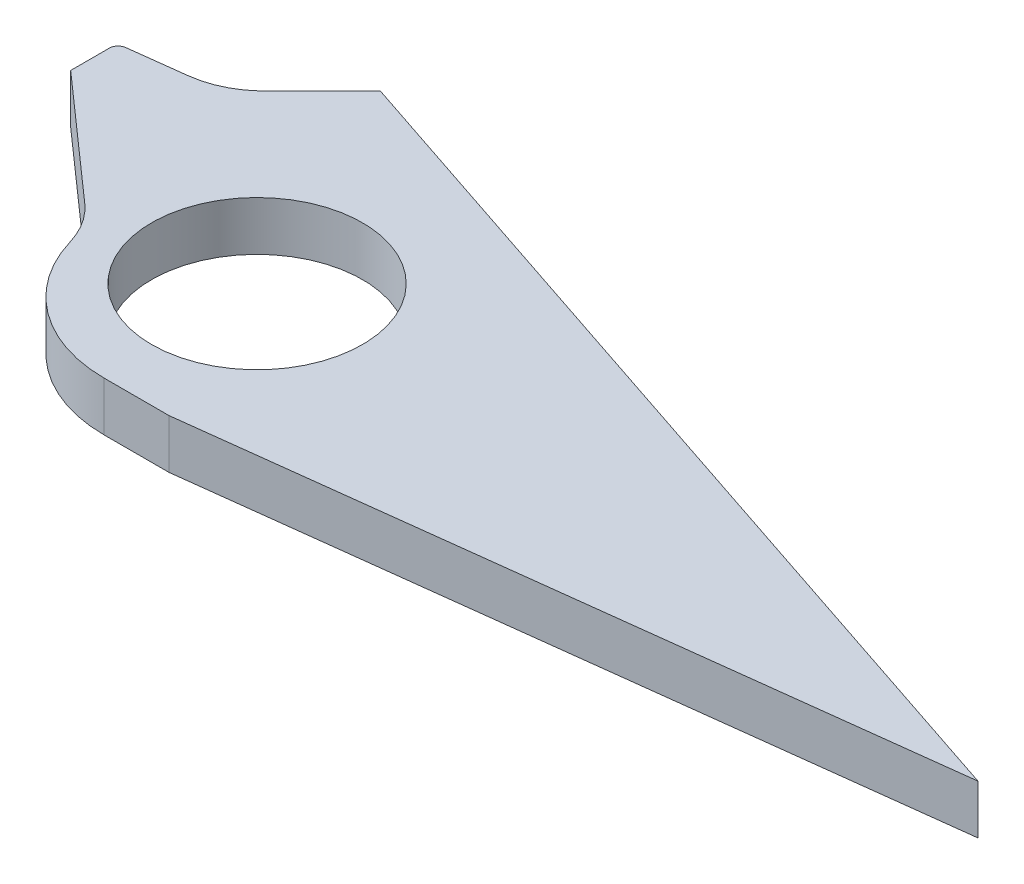
ISO-10303-21;
HEADER;
FILE_DESCRIPTION(('STEP AP214'),'2;1');
FILE_NAME('part.step','',(''),(''),'','','');
FILE_SCHEMA(('AUTOMOTIVE_DESIGN { 1 0 10303 214 1 1 1 1 }'));
ENDSEC;
DATA;
#1=APPLICATION_CONTEXT('core data for automotive mechanical design processes');
#2=APPLICATION_PROTOCOL_DEFINITION('international standard','automotive_design',2000,#1);
#3=PRODUCT_CONTEXT('',#1,'mechanical');
#4=PRODUCT('Part','Part','',(#3));
#5=PRODUCT_RELATED_PRODUCT_CATEGORY('part','',(#4));
#6=PRODUCT_DEFINITION_FORMATION('','',#4);
#7=PRODUCT_DEFINITION_CONTEXT('part definition',#1,'design');
#8=PRODUCT_DEFINITION('design','',#6,#7);
#9=PRODUCT_DEFINITION_SHAPE('','',#8);
#10=(LENGTH_UNIT() NAMED_UNIT(*) SI_UNIT(.MILLI.,.METRE.));
#11=(NAMED_UNIT(*) PLANE_ANGLE_UNIT() SI_UNIT($,.RADIAN.));
#12=(NAMED_UNIT(*) SI_UNIT($,.STERADIAN.) SOLID_ANGLE_UNIT());
#13=UNCERTAINTY_MEASURE_WITH_UNIT(LENGTH_MEASURE(1.E-05),#10,'distance_accuracy_value','');
#14=(GEOMETRIC_REPRESENTATION_CONTEXT(3) GLOBAL_UNCERTAINTY_ASSIGNED_CONTEXT((#13)) GLOBAL_UNIT_ASSIGNED_CONTEXT((#10,
#11,#12)) REPRESENTATION_CONTEXT('',''));
#15=CARTESIAN_POINT('',(0.,0.,0.));
#16=DIRECTION('',(0.,0.,1.));
#17=DIRECTION('',(1.,0.,0.));
#18=AXIS2_PLACEMENT_3D('',#15,#16,#17);
#19=CARTESIAN_POINT('',(0.,2.8,0.));
#20=DIRECTION('',(0.,-1.,0.));
#21=DIRECTION('',(0.,0.,-1.));
#22=AXIS2_PLACEMENT_3D('',#19,#20,#21);
#23=PLANE('',#22);
#24=CARTESIAN_POINT('',(-12.1601331036333,2.8,4.69548031513581));
#25=DIRECTION('',(0.,-1.,0.));
#26=DIRECTION('',(0.,0.,-1.));
#27=AXIS2_PLACEMENT_3D('',#24,#25,#26);
#28=CIRCLE('',#27,5.);
#29=CARTESIAN_POINT('',(-8.8472636926182,2.8,0.950497502683905));
#30=VERTEX_POINT('',#29);
#31=CARTESIAN_POINT('',(-7.36640838967638,2.8,3.27414173239127));
#32=VERTEX_POINT('',#31);
#33=EDGE_CURVE('E204',#30,#32,#28,.T.);
#34=ORIENTED_EDGE('',*,*,#33,.T.);
#35=CARTESIAN_POINT('',(0.303551152654753,2.8,1.));
#36=DIRECTION('',(0.,-1.,0.));
#37=DIRECTION('',(0.,0.,-1.));
#38=AXIS2_PLACEMENT_3D('',#35,#36,#37);
#39=CIRCLE('',#38,8.);
#40=CARTESIAN_POINT('',(0.303551152654754,2.8,9.));
#41=VERTEX_POINT('',#40);
#42=EDGE_CURVE('E11',#32,#41,#39,.F.);
#43=ORIENTED_EDGE('',*,*,#42,.T.);
#44=DIRECTION('',(1.,0.,0.));
#45=VECTOR('',#44,1.);
#46=CARTESIAN_POINT('',(4.,2.8,9.));
#47=LINE('',#46,#45);
#48=CARTESIAN_POINT('',(4.,2.8,9.));
#49=VERTEX_POINT('',#48);
#50=EDGE_CURVE('E149',#41,#49,#47,.T.);
#51=ORIENTED_EDGE('',*,*,#50,.T.);
#52=DIRECTION('',(0.992645877550526,0.,-0.12105437531104));
#53=VECTOR('',#52,1.);
#54=CARTESIAN_POINT('',(45.,2.8,3.99999999999999));
#55=LINE('',#54,#53);
#56=CARTESIAN_POINT('',(45.,2.8,3.99999999999999));
#57=VERTEX_POINT('',#56);
#58=EDGE_CURVE('E151',#49,#57,#55,.T.);
#59=ORIENTED_EDGE('',*,*,#58,.T.);
#60=DIRECTION('',(-0.948683298050514,0.,-0.316227766016838));
#61=VECTOR('',#60,1.);
#62=CARTESIAN_POINT('',(-6.,2.8,-13.));
#63=LINE('',#62,#61);
#64=CARTESIAN_POINT('',(-6.,2.8,-13.));
#65=VERTEX_POINT('',#64);
#66=EDGE_CURVE('E156',#57,#65,#63,.T.);
#67=ORIENTED_EDGE('',*,*,#66,.T.);
#68=DIRECTION('',(-0.707106781186548,0.,0.707106781186547));
#69=VECTOR('',#68,1.);
#70=CARTESIAN_POINT('',(-9.00000000000001,2.8,-10.));
#71=LINE('',#70,#69);
#72=CARTESIAN_POINT('',(-9.00000000000001,2.8,-10.));
#73=VERTEX_POINT('',#72);
#74=EDGE_CURVE('E158',#65,#73,#71,.T.);
#75=ORIENTED_EDGE('',*,*,#74,.T.);
#76=CARTESIAN_POINT('',(-12.8030585838502,2.8,-13.2460353368076));
#77=DIRECTION('',(0.,-1.,0.));
#78=DIRECTION('',(0.,0.,-1.));
#79=AXIS2_PLACEMENT_3D('',#76,#77,#78);
#80=CIRCLE('',#79,5.);
#81=CARTESIAN_POINT('',(-12.1937118668244,2.8,-8.28330457860096));
#82=VERTEX_POINT('',#81);
#83=EDGE_CURVE('E190',#73,#82,#80,.T.);
#84=ORIENTED_EDGE('',*,*,#83,.T.);
#85=DIRECTION('',(0.992546151641321,0.,-0.121869343405155));
#86=VECTOR('',#85,1.);
#87=CARTESIAN_POINT('',(-15.8,2.8,-7.84050807367962));
#88=LINE('',#87,#86);
#89=CARTESIAN_POINT('',(-15.3609346717026,2.8,-7.89441851722231));
#90=VERTEX_POINT('',#89);
#91=EDGE_CURVE('E185',#82,#90,#88,.F.);
#92=ORIENTED_EDGE('',*,*,#91,.T.);
#93=CARTESIAN_POINT('',(-15.3,2.8,-7.39814544140165));
#94=DIRECTION('',(0.,-1.,0.));
#95=DIRECTION('',(0.,0.,-1.));
#96=AXIS2_PLACEMENT_3D('',#93,#94,#95);
#97=CIRCLE('',#96,0.5);
#98=CARTESIAN_POINT('',(-15.8,2.8,-7.39814544140165));
#99=VERTEX_POINT('',#98);
#100=EDGE_CURVE('E129',#90,#99,#97,.F.);
#101=ORIENTED_EDGE('',*,*,#100,.T.);
#102=DIRECTION('',(0.,0.,1.));
#103=VECTOR('',#102,1.);
#104=CARTESIAN_POINT('',(-15.8,2.8,-8.7));
#105=LINE('',#104,#103);
#106=CARTESIAN_POINT('',(-15.8,2.8,-5.2));
#107=VERTEX_POINT('',#106);
#108=EDGE_CURVE('E122',#99,#107,#105,.T.);
#109=ORIENTED_EDGE('',*,*,#108,.T.);
#110=DIRECTION('',(0.748996562490381,0.,0.662573882203029));
#111=VECTOR('',#110,1.);
#112=CARTESIAN_POINT('',(-15.8,2.8,-5.2));
#113=LINE('',#112,#111);
#114=EDGE_CURVE('E126',#107,#30,#113,.T.);
#115=ORIENTED_EDGE('',*,*,#114,.T.);
#116=EDGE_LOOP('',(#34,#43,#51,#59,#67,#75,#84,#92,#101,#109,#115));
#117=FACE_BOUND('',#116,.T.);
#118=CARTESIAN_POINT('',(0.,2.8,0.));
#119=DIRECTION('',(0.,1.,0.));
#120=DIRECTION('',(0.,0.,1.));
#121=AXIS2_PLACEMENT_3D('',#118,#119,#120);
#122=CIRCLE('',#121,6.);
#123=CARTESIAN_POINT('',(0.,2.8,6.));
#124=VERTEX_POINT('',#123);
#125=EDGE_CURVE('E164',#124,#124,#122,.T.);
#126=ORIENTED_EDGE('',*,*,#125,.F.);
#127=EDGE_LOOP('',(#126));
#128=FACE_BOUND('',#127,.T.);
#129=ADVANCED_FACE('F40',(#117,#128),#23,.F.);
#130=CARTESIAN_POINT('',(0.,0.,0.));
#131=DIRECTION('',(0.,-1.,0.));
#132=DIRECTION('',(0.,0.,-1.));
#133=AXIS2_PLACEMENT_3D('',#130,#131,#132);
#134=PLANE('',#133);
#135=DIRECTION('',(1.,0.,0.));
#136=VECTOR('',#135,1.);
#137=CARTESIAN_POINT('',(4.,0.,9.));
#138=LINE('',#137,#136);
#139=CARTESIAN_POINT('',(0.303551152654754,0.,9.));
#140=VERTEX_POINT('',#139);
#141=CARTESIAN_POINT('',(4.,0.,9.));
#142=VERTEX_POINT('',#141);
#143=EDGE_CURVE('E166',#140,#142,#138,.T.);
#144=ORIENTED_EDGE('',*,*,#143,.F.);
#145=CARTESIAN_POINT('',(0.303551152654753,0.,1.));
#146=DIRECTION('',(0.,-1.,0.));
#147=DIRECTION('',(0.,0.,-1.));
#148=AXIS2_PLACEMENT_3D('',#145,#146,#147);
#149=CIRCLE('',#148,8.);
#150=CARTESIAN_POINT('',(-7.36640838967638,0.,3.27414173239127));
#151=VERTEX_POINT('',#150);
#152=EDGE_CURVE('E62',#140,#151,#149,.T.);
#153=ORIENTED_EDGE('',*,*,#152,.T.);
#154=CARTESIAN_POINT('',(-12.1601331036333,0.,4.69548031513581));
#155=DIRECTION('',(0.,-1.,0.));
#156=DIRECTION('',(0.,0.,-1.));
#157=AXIS2_PLACEMENT_3D('',#154,#155,#156);
#158=CIRCLE('',#157,5.);
#159=CARTESIAN_POINT('',(-8.8472636926182,0.,0.950497502683905));
#160=VERTEX_POINT('',#159);
#161=EDGE_CURVE('E202',#151,#160,#158,.F.);
#162=ORIENTED_EDGE('',*,*,#161,.T.);
#163=DIRECTION('',(0.748996562490381,0.,0.662573882203029));
#164=VECTOR('',#163,1.);
#165=CARTESIAN_POINT('',(-15.8,0.,-5.2));
#166=LINE('',#165,#164);
#167=CARTESIAN_POINT('',(-15.8,0.,-5.2));
#168=VERTEX_POINT('',#167);
#169=EDGE_CURVE('E163',#168,#160,#166,.T.);
#170=ORIENTED_EDGE('',*,*,#169,.F.);
#171=DIRECTION('',(0.,0.,1.));
#172=VECTOR('',#171,1.);
#173=CARTESIAN_POINT('',(-15.8,0.,-8.7));
#174=LINE('',#173,#172);
#175=CARTESIAN_POINT('',(-15.8,0.,-7.39814544140165));
#176=VERTEX_POINT('',#175);
#177=EDGE_CURVE('E139',#176,#168,#174,.T.);
#178=ORIENTED_EDGE('',*,*,#177,.F.);
#179=CARTESIAN_POINT('',(-15.3,0.,-7.39814544140165));
#180=DIRECTION('',(0.,-1.,0.));
#181=DIRECTION('',(0.,0.,-1.));
#182=AXIS2_PLACEMENT_3D('',#179,#180,#181);
#183=CIRCLE('',#182,0.5);
#184=CARTESIAN_POINT('',(-15.3609346717026,0.,-7.89441851722231));
#185=VERTEX_POINT('',#184);
#186=EDGE_CURVE('E196',#176,#185,#183,.T.);
#187=ORIENTED_EDGE('',*,*,#186,.T.);
#188=DIRECTION('',(-0.992546151641321,0.,0.121869343405155));
#189=VECTOR('',#188,1.);
#190=CARTESIAN_POINT('',(-1.18305905024425,0.,-9.63524274993917));
#191=LINE('',#190,#189);
#192=CARTESIAN_POINT('',(-12.1937118668244,0.,-8.28330457860096));
#193=VERTEX_POINT('',#192);
#194=EDGE_CURVE('E143',#185,#193,#191,.F.);
#195=ORIENTED_EDGE('',*,*,#194,.T.);
#196=CARTESIAN_POINT('',(-12.8030585838502,0.,-13.2460353368076));
#197=DIRECTION('',(0.,-1.,0.));
#198=DIRECTION('',(0.,0.,-1.));
#199=AXIS2_PLACEMENT_3D('',#196,#197,#198);
#200=CIRCLE('',#199,5.);
#201=CARTESIAN_POINT('',(-9.00000000000001,0.,-10.));
#202=VERTEX_POINT('',#201);
#203=EDGE_CURVE('E192',#193,#202,#200,.F.);
#204=ORIENTED_EDGE('',*,*,#203,.T.);
#205=DIRECTION('',(-0.707106781186548,0.,0.707106781186547));
#206=VECTOR('',#205,1.);
#207=CARTESIAN_POINT('',(-9.00000000000001,0.,-10.));
#208=LINE('',#207,#206);
#209=CARTESIAN_POINT('',(-6.,0.,-13.));
#210=VERTEX_POINT('',#209);
#211=EDGE_CURVE('E133',#210,#202,#208,.T.);
#212=ORIENTED_EDGE('',*,*,#211,.F.);
#213=DIRECTION('',(-0.948683298050514,0.,-0.316227766016838));
#214=VECTOR('',#213,1.);
#215=CARTESIAN_POINT('',(-6.,0.,-13.));
#216=LINE('',#215,#214);
#217=CARTESIAN_POINT('',(45.,0.,3.99999999999999));
#218=VERTEX_POINT('',#217);
#219=EDGE_CURVE('E170',#218,#210,#216,.T.);
#220=ORIENTED_EDGE('',*,*,#219,.F.);
#221=DIRECTION('',(0.992645877550526,0.,-0.12105437531104));
#222=VECTOR('',#221,1.);
#223=CARTESIAN_POINT('',(45.,0.,3.99999999999999));
#224=LINE('',#223,#222);
#225=EDGE_CURVE('E168',#142,#218,#224,.T.);
#226=ORIENTED_EDGE('',*,*,#225,.F.);
#227=EDGE_LOOP('',(#144,#153,#162,#170,#178,#187,#195,#204,#212,#220,#226));
#228=FACE_BOUND('',#227,.T.);
#229=CARTESIAN_POINT('',(0.,0.,0.));
#230=DIRECTION('',(0.,1.,0.));
#231=DIRECTION('',(0.,0.,1.));
#232=AXIS2_PLACEMENT_3D('',#229,#230,#231);
#233=CIRCLE('',#232,6.);
#234=CARTESIAN_POINT('',(0.,0.,6.));
#235=VERTEX_POINT('',#234);
#236=EDGE_CURVE('E395',#235,#235,#233,.T.);
#237=ORIENTED_EDGE('',*,*,#236,.T.);
#238=EDGE_LOOP('',(#237));
#239=FACE_BOUND('',#238,.T.);
#240=ADVANCED_FACE('F217',(#228,#239),#134,.T.);
#241=CARTESIAN_POINT('',(-15.8,2.8,-8.7));
#242=DIRECTION('',(1.,0.,0.));
#243=DIRECTION('',(0.,0.,-1.));
#244=AXIS2_PLACEMENT_3D('',#241,#242,#243);
#245=PLANE('',#244);
#246=ORIENTED_EDGE('',*,*,#108,.F.);
#247=DIRECTION('',(0.,1.,0.));
#248=VECTOR('',#247,1.);
#249=CARTESIAN_POINT('',(-15.8,0.,-7.39814544140165));
#250=LINE('',#249,#248);
#251=EDGE_CURVE('E194',#99,#176,#250,.F.);
#252=ORIENTED_EDGE('',*,*,#251,.T.);
#253=ORIENTED_EDGE('',*,*,#177,.T.);
#254=DIRECTION('',(0.,-1.,0.));
#255=VECTOR('',#254,1.);
#256=CARTESIAN_POINT('',(-15.8,2.8,-5.2));
#257=LINE('',#256,#255);
#258=EDGE_CURVE('E136',#107,#168,#257,.T.);
#259=ORIENTED_EDGE('',*,*,#258,.F.);
#260=EDGE_LOOP('',(#246,#252,#253,#259));
#261=FACE_BOUND('',#260,.T.);
#262=ADVANCED_FACE('F137',(#261),#245,.F.);
#263=CARTESIAN_POINT('',(-15.8,2.8,-5.2));
#264=DIRECTION('',(0.662573882203029,0.,-0.748996562490381));
#265=DIRECTION('',(-0.748996562490381,0.,-0.662573882203029));
#266=AXIS2_PLACEMENT_3D('',#263,#264,#265);
#267=PLANE('',#266);
#268=ORIENTED_EDGE('',*,*,#169,.T.);
#269=DIRECTION('',(0.,-1.,0.));
#270=VECTOR('',#269,1.);
#271=CARTESIAN_POINT('',(-8.8472636926182,2.8,0.950497502683904));
#272=LINE('',#271,#270);
#273=EDGE_CURVE('E148',#160,#30,#272,.F.);
#274=ORIENTED_EDGE('',*,*,#273,.T.);
#275=ORIENTED_EDGE('',*,*,#114,.F.);
#276=ORIENTED_EDGE('',*,*,#258,.T.);
#277=EDGE_LOOP('',(#268,#274,#275,#276));
#278=FACE_BOUND('',#277,.T.);
#279=ADVANCED_FACE('F146',(#278),#267,.F.);
#280=CARTESIAN_POINT('',(4.,2.8,9.));
#281=DIRECTION('',(0.,0.,-1.));
#282=DIRECTION('',(-1.,0.,0.));
#283=AXIS2_PLACEMENT_3D('',#280,#281,#282);
#284=PLANE('',#283);
#285=ORIENTED_EDGE('',*,*,#50,.F.);
#286=DIRECTION('',(0.,1.,0.));
#287=VECTOR('',#286,1.);
#288=CARTESIAN_POINT('',(0.303551152654754,2.8,9.));
#289=LINE('',#288,#287);
#290=EDGE_CURVE('E206',#41,#140,#289,.F.);
#291=ORIENTED_EDGE('',*,*,#290,.T.);
#292=ORIENTED_EDGE('',*,*,#143,.T.);
#293=DIRECTION('',(0.,-1.,0.));
#294=VECTOR('',#293,1.);
#295=CARTESIAN_POINT('',(4.,2.8,9.));
#296=LINE('',#295,#294);
#297=EDGE_CURVE('E144',#49,#142,#296,.T.);
#298=ORIENTED_EDGE('',*,*,#297,.F.);
#299=EDGE_LOOP('',(#285,#291,#292,#298));
#300=FACE_BOUND('',#299,.T.);
#301=ADVANCED_FACE('F212',(#300),#284,.F.);
#302=CARTESIAN_POINT('',(45.,2.8,3.99999999999999));
#303=DIRECTION('',(-0.12105437531104,0.,-0.992645877550526));
#304=DIRECTION('',(-0.992645877550526,0.,0.12105437531104));
#305=AXIS2_PLACEMENT_3D('',#302,#303,#304);
#306=PLANE('',#305);
#307=ORIENTED_EDGE('',*,*,#225,.T.);
#308=DIRECTION('',(0.,-1.,0.));
#309=VECTOR('',#308,1.);
#310=CARTESIAN_POINT('',(45.,2.8,3.99999999999999));
#311=LINE('',#310,#309);
#312=EDGE_CURVE('E179',#57,#218,#311,.T.);
#313=ORIENTED_EDGE('',*,*,#312,.F.);
#314=ORIENTED_EDGE('',*,*,#58,.F.);
#315=ORIENTED_EDGE('',*,*,#297,.T.);
#316=EDGE_LOOP('',(#307,#313,#314,#315));
#317=FACE_BOUND('',#316,.T.);
#318=ADVANCED_FACE('F223',(#317),#306,.F.);
#319=CARTESIAN_POINT('',(-6.,2.8,-13.));
#320=DIRECTION('',(-0.316227766016838,0.,0.948683298050514));
#321=DIRECTION('',(0.948683298050514,0.,0.316227766016838));
#322=AXIS2_PLACEMENT_3D('',#319,#320,#321);
#323=PLANE('',#322);
#324=ORIENTED_EDGE('',*,*,#219,.T.);
#325=DIRECTION('',(0.,-1.,0.));
#326=VECTOR('',#325,1.);
#327=CARTESIAN_POINT('',(-6.,2.8,-13.));
#328=LINE('',#327,#326);
#329=EDGE_CURVE('E176',#65,#210,#328,.T.);
#330=ORIENTED_EDGE('',*,*,#329,.F.);
#331=ORIENTED_EDGE('',*,*,#66,.F.);
#332=ORIENTED_EDGE('',*,*,#312,.T.);
#333=EDGE_LOOP('',(#324,#330,#331,#332));
#334=FACE_BOUND('',#333,.T.);
#335=ADVANCED_FACE('F227',(#334),#323,.F.);
#336=CARTESIAN_POINT('',(-9.00000000000001,2.8,-10.));
#337=DIRECTION('',(0.707106781186547,0.,0.707106781186548));
#338=DIRECTION('',(0.707106781186548,0.,-0.707106781186547));
#339=AXIS2_PLACEMENT_3D('',#336,#337,#338);
#340=PLANE('',#339);
#341=ORIENTED_EDGE('',*,*,#211,.T.);
#342=DIRECTION('',(0.,-1.,0.));
#343=VECTOR('',#342,1.);
#344=CARTESIAN_POINT('',(-9.00000000000001,2.8,-10.));
#345=LINE('',#344,#343);
#346=EDGE_CURVE('E161',#73,#202,#345,.T.);
#347=ORIENTED_EDGE('',*,*,#346,.F.);
#348=ORIENTED_EDGE('',*,*,#74,.F.);
#349=ORIENTED_EDGE('',*,*,#329,.T.);
#350=EDGE_LOOP('',(#341,#347,#348,#349));
#351=FACE_BOUND('',#350,.T.);
#352=ADVANCED_FACE('F246',(#351),#340,.F.);
#353=CARTESIAN_POINT('',(0.,2.8,0.));
#354=DIRECTION('',(0.,-1.,0.));
#355=DIRECTION('',(0.,0.,-1.));
#356=AXIS2_PLACEMENT_3D('',#353,#354,#355);
#357=CYLINDRICAL_SURFACE('',#356,6.);
#358=ORIENTED_EDGE('',*,*,#125,.T.);
#359=EDGE_LOOP('',(#358));
#360=FACE_BOUND('',#359,.T.);
#361=ORIENTED_EDGE('',*,*,#236,.F.);
#362=EDGE_LOOP('',(#361));
#363=FACE_BOUND('',#362,.T.);
#364=ADVANCED_FACE('F244',(#360,#363),#357,.F.);
#365=CARTESIAN_POINT('',(-15.8,2.8,-7.84050807367962));
#366=DIRECTION('',(0.121869343405155,0.,0.992546151641321));
#367=DIRECTION('',(0.,-1.,0.));
#368=AXIS2_PLACEMENT_3D('',#365,#366,#367);
#369=PLANE('',#368);
#370=ORIENTED_EDGE('',*,*,#194,.F.);
#371=DIRECTION('',(0.,-1.,0.));
#372=VECTOR('',#371,1.);
#373=CARTESIAN_POINT('',(-15.3609346717026,2.8,-7.89441851722231));
#374=LINE('',#373,#372);
#375=EDGE_CURVE('E198',#185,#90,#374,.F.);
#376=ORIENTED_EDGE('',*,*,#375,.T.);
#377=ORIENTED_EDGE('',*,*,#91,.F.);
#378=DIRECTION('',(0.,-1.,0.));
#379=VECTOR('',#378,1.);
#380=CARTESIAN_POINT('',(-12.1937118668244,0.,-8.28330457860096));
#381=LINE('',#380,#379);
#382=EDGE_CURVE('E187',#82,#193,#381,.T.);
#383=ORIENTED_EDGE('',*,*,#382,.T.);
#384=EDGE_LOOP('',(#370,#376,#377,#383));
#385=FACE_BOUND('',#384,.T.);
#386=ADVANCED_FACE('F261',(#385),#369,.F.);
#387=CARTESIAN_POINT('',(-12.8030585838502,2.8,-13.2460353368076));
#388=DIRECTION('',(0.,-1.,0.));
#389=DIRECTION('',(0.,0.,-1.));
#390=AXIS2_PLACEMENT_3D('',#387,#388,#389);
#391=CYLINDRICAL_SURFACE('',#390,5.);
#392=ORIENTED_EDGE('',*,*,#203,.F.);
#393=ORIENTED_EDGE('',*,*,#382,.F.);
#394=ORIENTED_EDGE('',*,*,#83,.F.);
#395=ORIENTED_EDGE('',*,*,#346,.T.);
#396=EDGE_LOOP('',(#392,#393,#394,#395));
#397=FACE_BOUND('',#396,.T.);
#398=ADVANCED_FACE('F266',(#397),#391,.F.);
#399=CARTESIAN_POINT('',(-15.3,2.8,-7.39814544140165));
#400=DIRECTION('',(0.,-1.,0.));
#401=DIRECTION('',(0.,0.,-1.));
#402=AXIS2_PLACEMENT_3D('',#399,#400,#401);
#403=CYLINDRICAL_SURFACE('',#402,0.5);
#404=ORIENTED_EDGE('',*,*,#100,.F.);
#405=ORIENTED_EDGE('',*,*,#375,.F.);
#406=ORIENTED_EDGE('',*,*,#186,.F.);
#407=ORIENTED_EDGE('',*,*,#251,.F.);
#408=EDGE_LOOP('',(#404,#405,#406,#407));
#409=FACE_BOUND('',#408,.T.);
#410=ADVANCED_FACE('F236',(#409),#403,.T.);
#411=CARTESIAN_POINT('',(-12.1601331036333,2.8,4.69548031513581));
#412=DIRECTION('',(0.,1.,0.));
#413=DIRECTION('',(0.,0.,1.));
#414=AXIS2_PLACEMENT_3D('',#411,#412,#413);
#415=CYLINDRICAL_SURFACE('',#414,5.);
#416=ORIENTED_EDGE('',*,*,#161,.F.);
#417=DIRECTION('',(0.,1.,0.));
#418=VECTOR('',#417,1.);
#419=CARTESIAN_POINT('',(-7.36640838967638,2.8,3.27414173239127));
#420=LINE('',#419,#418);
#421=EDGE_CURVE('E48',#151,#32,#420,.T.);
#422=ORIENTED_EDGE('',*,*,#421,.T.);
#423=ORIENTED_EDGE('',*,*,#33,.F.);
#424=ORIENTED_EDGE('',*,*,#273,.F.);
#425=EDGE_LOOP('',(#416,#422,#423,#424));
#426=FACE_BOUND('',#425,.T.);
#427=ADVANCED_FACE('F232',(#426),#415,.F.);
#428=CARTESIAN_POINT('',(0.303551152654753,2.8,1.));
#429=DIRECTION('',(0.,1.,0.));
#430=DIRECTION('',(0.,0.,1.));
#431=AXIS2_PLACEMENT_3D('',#428,#429,#430);
#432=CYLINDRICAL_SURFACE('',#431,8.);
#433=ORIENTED_EDGE('',*,*,#42,.F.);
#434=ORIENTED_EDGE('',*,*,#421,.F.);
#435=ORIENTED_EDGE('',*,*,#152,.F.);
#436=ORIENTED_EDGE('',*,*,#290,.F.);
#437=EDGE_LOOP('',(#433,#434,#435,#436));
#438=FACE_BOUND('',#437,.T.);
#439=ADVANCED_FACE('F42',(#438),#432,.T.);
#440=CLOSED_SHELL('',(#129,#240,#262,#279,#301,#318,#335,#352,#364,#386,#398,#410,#427,#439));
#441=MANIFOLD_SOLID_BREP('B2',#440);
#442=ADVANCED_BREP_SHAPE_REPRESENTATION('',(#18,#441),#14);
#443=SHAPE_DEFINITION_REPRESENTATION(#9,#442);
ENDSEC;
END-ISO-10303-21;
